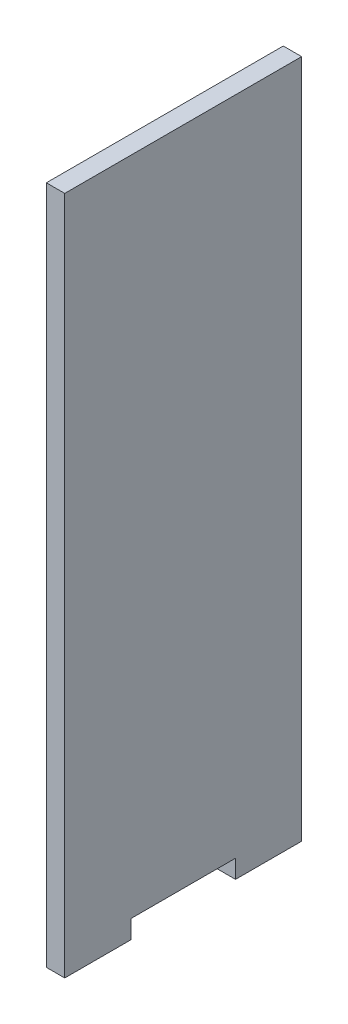
ISO-10303-21;
HEADER;
FILE_DESCRIPTION(('STEP AP214'),'2;1');
FILE_NAME('part.step','',(''),(''),'','','');
FILE_SCHEMA(('AUTOMOTIVE_DESIGN { 1 0 10303 214 1 1 1 1 }'));
ENDSEC;
DATA;
#1=APPLICATION_CONTEXT('core data for automotive mechanical design processes');
#2=APPLICATION_PROTOCOL_DEFINITION('international standard','automotive_design',2000,#1);
#3=PRODUCT_CONTEXT('',#1,'mechanical');
#4=PRODUCT('Part','Part','',(#3));
#5=PRODUCT_RELATED_PRODUCT_CATEGORY('part','',(#4));
#6=PRODUCT_DEFINITION_FORMATION('','',#4);
#7=PRODUCT_DEFINITION_CONTEXT('part definition',#1,'design');
#8=PRODUCT_DEFINITION('design','',#6,#7);
#9=PRODUCT_DEFINITION_SHAPE('','',#8);
#10=(LENGTH_UNIT() NAMED_UNIT(*) SI_UNIT(.MILLI.,.METRE.));
#11=(NAMED_UNIT(*) PLANE_ANGLE_UNIT() SI_UNIT($,.RADIAN.));
#12=(NAMED_UNIT(*) SI_UNIT($,.STERADIAN.) SOLID_ANGLE_UNIT());
#13=UNCERTAINTY_MEASURE_WITH_UNIT(LENGTH_MEASURE(1.E-05),#10,'distance_accuracy_value','');
#14=(GEOMETRIC_REPRESENTATION_CONTEXT(3) GLOBAL_UNCERTAINTY_ASSIGNED_CONTEXT((#13)) GLOBAL_UNIT_ASSIGNED_CONTEXT((#10,
#11,#12)) REPRESENTATION_CONTEXT('',''));
#15=CARTESIAN_POINT('',(0.,0.,0.));
#16=DIRECTION('',(0.,0.,1.));
#17=DIRECTION('',(1.,0.,0.));
#18=AXIS2_PLACEMENT_3D('',#15,#16,#17);
#19=CARTESIAN_POINT('',(5.,0.,32.25));
#20=DIRECTION('',(0.,0.,-1.));
#21=DIRECTION('',(-1.,0.,0.));
#22=AXIS2_PLACEMENT_3D('',#19,#20,#21);
#23=PLANE('',#22);
#24=DIRECTION('',(0.,-1.,0.));
#25=VECTOR('',#24,1.);
#26=CARTESIAN_POINT('',(0.,0.,32.25));
#27=LINE('',#26,#25);
#28=CARTESIAN_POINT('',(0.,180.,32.25));
#29=VERTEX_POINT('',#28);
#30=CARTESIAN_POINT('',(0.,-5.,32.25));
#31=VERTEX_POINT('',#30);
#32=EDGE_CURVE('E84',#29,#31,#27,.T.);
#33=ORIENTED_EDGE('',*,*,#32,.T.);
#34=DIRECTION('',(-1.,0.,0.));
#35=VECTOR('',#34,1.);
#36=CARTESIAN_POINT('',(5.,-5.,32.25));
#37=LINE('',#36,#35);
#38=CARTESIAN_POINT('',(5.,-5.,32.25));
#39=VERTEX_POINT('',#38);
#40=EDGE_CURVE('E11',#39,#31,#37,.T.);
#41=ORIENTED_EDGE('',*,*,#40,.F.);
#42=DIRECTION('',(0.,-1.,0.));
#43=VECTOR('',#42,1.);
#44=CARTESIAN_POINT('',(5.,180.,32.25));
#45=LINE('',#44,#43);
#46=CARTESIAN_POINT('',(5.,180.,32.25));
#47=VERTEX_POINT('',#46);
#48=EDGE_CURVE('E90',#47,#39,#45,.T.);
#49=ORIENTED_EDGE('',*,*,#48,.F.);
#50=DIRECTION('',(-1.,0.,0.));
#51=VECTOR('',#50,1.);
#52=CARTESIAN_POINT('',(5.,180.,32.25));
#53=LINE('',#52,#51);
#54=EDGE_CURVE('E125',#47,#29,#53,.T.);
#55=ORIENTED_EDGE('',*,*,#54,.T.);
#56=EDGE_LOOP('',(#33,#41,#49,#55));
#57=FACE_BOUND('',#56,.T.);
#58=ADVANCED_FACE('F33',(#57),#23,.F.);
#59=CARTESIAN_POINT('',(5.,-5.,32.25));
#60=DIRECTION('',(0.,1.,0.));
#61=DIRECTION('',(0.,0.,1.));
#62=AXIS2_PLACEMENT_3D('',#59,#60,#61);
#63=PLANE('',#62);
#64=DIRECTION('',(0.,0.,-1.));
#65=VECTOR('',#64,1.);
#66=CARTESIAN_POINT('',(0.,-5.,32.25));
#67=LINE('',#66,#65);
#68=CARTESIAN_POINT('',(0.,-5.00000000000002,14.25));
#69=VERTEX_POINT('',#68);
#70=EDGE_CURVE('E130',#31,#69,#67,.T.);
#71=ORIENTED_EDGE('',*,*,#70,.T.);
#72=DIRECTION('',(-1.,0.,0.));
#73=VECTOR('',#72,1.);
#74=CARTESIAN_POINT('',(5.,-5.00000000000002,14.25));
#75=LINE('',#74,#73);
#76=CARTESIAN_POINT('',(5.,-5.00000000000002,14.25));
#77=VERTEX_POINT('',#76);
#78=EDGE_CURVE('E41',#77,#69,#75,.T.);
#79=ORIENTED_EDGE('',*,*,#78,.F.);
#80=DIRECTION('',(0.,0.,-1.));
#81=VECTOR('',#80,1.);
#82=CARTESIAN_POINT('',(5.,-5.,32.25));
#83=LINE('',#82,#81);
#84=EDGE_CURVE('E174',#39,#77,#83,.T.);
#85=ORIENTED_EDGE('',*,*,#84,.F.);
#86=ORIENTED_EDGE('',*,*,#40,.T.);
#87=EDGE_LOOP('',(#71,#79,#85,#86));
#88=FACE_BOUND('',#87,.T.);
#89=ADVANCED_FACE('F176',(#88),#63,.F.);
#90=CARTESIAN_POINT('',(5.,-5.00000000000002,14.25));
#91=DIRECTION('',(0.,0.,1.));
#92=DIRECTION('',(1.,0.,0.));
#93=AXIS2_PLACEMENT_3D('',#90,#91,#92);
#94=PLANE('',#93);
#95=DIRECTION('',(0.,1.,0.));
#96=VECTOR('',#95,1.);
#97=CARTESIAN_POINT('',(0.,-5.00000000000002,14.25));
#98=LINE('',#97,#96);
#99=CARTESIAN_POINT('',(0.,0.,14.25));
#100=VERTEX_POINT('',#99);
#101=EDGE_CURVE('E132',#69,#100,#98,.T.);
#102=ORIENTED_EDGE('',*,*,#101,.T.);
#103=DIRECTION('',(-1.,0.,0.));
#104=VECTOR('',#103,1.);
#105=CARTESIAN_POINT('',(5.,0.,14.25));
#106=LINE('',#105,#104);
#107=CARTESIAN_POINT('',(5.,0.,14.25));
#108=VERTEX_POINT('',#107);
#109=EDGE_CURVE('E149',#108,#100,#106,.T.);
#110=ORIENTED_EDGE('',*,*,#109,.F.);
#111=DIRECTION('',(0.,1.,0.));
#112=VECTOR('',#111,1.);
#113=CARTESIAN_POINT('',(5.,-5.00000000000002,14.25));
#114=LINE('',#113,#112);
#115=EDGE_CURVE('E158',#77,#108,#114,.T.);
#116=ORIENTED_EDGE('',*,*,#115,.F.);
#117=ORIENTED_EDGE('',*,*,#78,.T.);
#118=EDGE_LOOP('',(#102,#110,#116,#117));
#119=FACE_BOUND('',#118,.T.);
#120=ADVANCED_FACE('F156',(#119),#94,.F.);
#121=CARTESIAN_POINT('',(5.,0.,14.25));
#122=DIRECTION('',(0.,1.,0.));
#123=DIRECTION('',(0.,0.,1.));
#124=AXIS2_PLACEMENT_3D('',#121,#122,#123);
#125=PLANE('',#124);
#126=DIRECTION('',(0.,0.,-1.));
#127=VECTOR('',#126,1.);
#128=CARTESIAN_POINT('',(0.,0.,14.25));
#129=LINE('',#128,#127);
#130=CARTESIAN_POINT('',(0.,0.,-14.25));
#131=VERTEX_POINT('',#130);
#132=EDGE_CURVE('E134',#100,#131,#129,.T.);
#133=ORIENTED_EDGE('',*,*,#132,.T.);
#134=DIRECTION('',(-1.,0.,0.));
#135=VECTOR('',#134,1.);
#136=CARTESIAN_POINT('',(5.,0.,-14.25));
#137=LINE('',#136,#135);
#138=CARTESIAN_POINT('',(5.,0.,-14.25));
#139=VERTEX_POINT('',#138);
#140=EDGE_CURVE('E146',#139,#131,#137,.T.);
#141=ORIENTED_EDGE('',*,*,#140,.F.);
#142=DIRECTION('',(0.,0.,-1.));
#143=VECTOR('',#142,1.);
#144=CARTESIAN_POINT('',(5.,0.,14.25));
#145=LINE('',#144,#143);
#146=EDGE_CURVE('E170',#108,#139,#145,.T.);
#147=ORIENTED_EDGE('',*,*,#146,.F.);
#148=ORIENTED_EDGE('',*,*,#109,.T.);
#149=EDGE_LOOP('',(#133,#141,#147,#148));
#150=FACE_BOUND('',#149,.T.);
#151=ADVANCED_FACE('F166',(#150),#125,.F.);
#152=CARTESIAN_POINT('',(5.,-5.00000000000002,-14.25));
#153=DIRECTION('',(0.,0.,-1.));
#154=DIRECTION('',(-1.,0.,0.));
#155=AXIS2_PLACEMENT_3D('',#152,#153,#154);
#156=PLANE('',#155);
#157=DIRECTION('',(0.,-1.,0.));
#158=VECTOR('',#157,1.);
#159=CARTESIAN_POINT('',(0.,-5.00000000000002,-14.25));
#160=LINE('',#159,#158);
#161=CARTESIAN_POINT('',(0.,-5.00000000000002,-14.25));
#162=VERTEX_POINT('',#161);
#163=EDGE_CURVE('E136',#131,#162,#160,.T.);
#164=ORIENTED_EDGE('',*,*,#163,.T.);
#165=DIRECTION('',(-1.,0.,0.));
#166=VECTOR('',#165,1.);
#167=CARTESIAN_POINT('',(5.,-5.00000000000002,-14.25));
#168=LINE('',#167,#166);
#169=CARTESIAN_POINT('',(5.,-5.00000000000002,-14.25));
#170=VERTEX_POINT('',#169);
#171=EDGE_CURVE('E120',#170,#162,#168,.T.);
#172=ORIENTED_EDGE('',*,*,#171,.F.);
#173=DIRECTION('',(0.,-1.,0.));
#174=VECTOR('',#173,1.);
#175=CARTESIAN_POINT('',(5.,-5.00000000000002,-14.25));
#176=LINE('',#175,#174);
#177=EDGE_CURVE('E110',#139,#170,#176,.T.);
#178=ORIENTED_EDGE('',*,*,#177,.F.);
#179=ORIENTED_EDGE('',*,*,#140,.T.);
#180=EDGE_LOOP('',(#164,#172,#178,#179));
#181=FACE_BOUND('',#180,.T.);
#182=ADVANCED_FACE('F169',(#181),#156,.F.);
#183=CARTESIAN_POINT('',(5.,-4.99999999999999,-32.25));
#184=DIRECTION('',(0.,1.,0.));
#185=DIRECTION('',(0.,0.,1.));
#186=AXIS2_PLACEMENT_3D('',#183,#184,#185);
#187=PLANE('',#186);
#188=DIRECTION('',(0.,0.,-1.));
#189=VECTOR('',#188,1.);
#190=CARTESIAN_POINT('',(0.,-4.99999999999999,-32.25));
#191=LINE('',#190,#189);
#192=CARTESIAN_POINT('',(0.,-4.99999999999999,-32.25));
#193=VERTEX_POINT('',#192);
#194=EDGE_CURVE('E119',#162,#193,#191,.T.);
#195=ORIENTED_EDGE('',*,*,#194,.T.);
#196=DIRECTION('',(-1.,0.,0.));
#197=VECTOR('',#196,1.);
#198=CARTESIAN_POINT('',(5.,-4.99999999999999,-32.25));
#199=LINE('',#198,#197);
#200=CARTESIAN_POINT('',(5.,-4.99999999999999,-32.25));
#201=VERTEX_POINT('',#200);
#202=EDGE_CURVE('E116',#201,#193,#199,.T.);
#203=ORIENTED_EDGE('',*,*,#202,.F.);
#204=DIRECTION('',(0.,0.,-1.));
#205=VECTOR('',#204,1.);
#206=CARTESIAN_POINT('',(5.,-4.99999999999999,-32.25));
#207=LINE('',#206,#205);
#208=EDGE_CURVE('E104',#170,#201,#207,.T.);
#209=ORIENTED_EDGE('',*,*,#208,.F.);
#210=ORIENTED_EDGE('',*,*,#171,.T.);
#211=EDGE_LOOP('',(#195,#203,#209,#210));
#212=FACE_BOUND('',#211,.T.);
#213=ADVANCED_FACE('F117',(#212),#187,.F.);
#214=CARTESIAN_POINT('',(5.,180.,-32.25));
#215=DIRECTION('',(0.,0.,1.));
#216=DIRECTION('',(0.,-1.,0.));
#217=AXIS2_PLACEMENT_3D('',#214,#215,#216);
#218=PLANE('',#217);
#219=DIRECTION('',(0.,1.,0.));
#220=VECTOR('',#219,1.);
#221=CARTESIAN_POINT('',(0.,180.,-32.25));
#222=LINE('',#221,#220);
#223=CARTESIAN_POINT('',(0.,180.,-32.25));
#224=VERTEX_POINT('',#223);
#225=EDGE_CURVE('E77',#193,#224,#222,.T.);
#226=ORIENTED_EDGE('',*,*,#225,.T.);
#227=DIRECTION('',(-1.,0.,0.));
#228=VECTOR('',#227,1.);
#229=CARTESIAN_POINT('',(5.,180.,-32.25));
#230=LINE('',#229,#228);
#231=CARTESIAN_POINT('',(5.,180.,-32.25));
#232=VERTEX_POINT('',#231);
#233=EDGE_CURVE('E121',#232,#224,#230,.T.);
#234=ORIENTED_EDGE('',*,*,#233,.F.);
#235=DIRECTION('',(0.,1.,0.));
#236=VECTOR('',#235,1.);
#237=CARTESIAN_POINT('',(5.,0.,-32.25));
#238=LINE('',#237,#236);
#239=EDGE_CURVE('E108',#201,#232,#238,.T.);
#240=ORIENTED_EDGE('',*,*,#239,.F.);
#241=ORIENTED_EDGE('',*,*,#202,.T.);
#242=EDGE_LOOP('',(#226,#234,#240,#241));
#243=FACE_BOUND('',#242,.T.);
#244=ADVANCED_FACE('F123',(#243),#218,.F.);
#245=CARTESIAN_POINT('',(5.,180.,32.25));
#246=DIRECTION('',(0.,-1.,0.));
#247=DIRECTION('',(0.,0.,-1.));
#248=AXIS2_PLACEMENT_3D('',#245,#246,#247);
#249=PLANE('',#248);
#250=DIRECTION('',(0.,0.,1.));
#251=VECTOR('',#250,1.);
#252=CARTESIAN_POINT('',(0.,180.,32.25));
#253=LINE('',#252,#251);
#254=EDGE_CURVE('E140',#224,#29,#253,.T.);
#255=ORIENTED_EDGE('',*,*,#254,.T.);
#256=ORIENTED_EDGE('',*,*,#54,.F.);
#257=DIRECTION('',(0.,0.,1.));
#258=VECTOR('',#257,1.);
#259=CARTESIAN_POINT('',(5.,180.,32.25));
#260=LINE('',#259,#258);
#261=EDGE_CURVE('E49',#232,#47,#260,.T.);
#262=ORIENTED_EDGE('',*,*,#261,.F.);
#263=ORIENTED_EDGE('',*,*,#233,.T.);
#264=EDGE_LOOP('',(#255,#256,#262,#263));
#265=FACE_BOUND('',#264,.T.);
#266=ADVANCED_FACE('F179',(#265),#249,.F.);
#267=CARTESIAN_POINT('',(5.,0.,0.));
#268=DIRECTION('',(1.,0.,0.));
#269=DIRECTION('',(0.,0.,-1.));
#270=AXIS2_PLACEMENT_3D('',#267,#268,#269);
#271=PLANE('',#270);
#272=ORIENTED_EDGE('',*,*,#48,.T.);
#273=ORIENTED_EDGE('',*,*,#84,.T.);
#274=ORIENTED_EDGE('',*,*,#115,.T.);
#275=ORIENTED_EDGE('',*,*,#146,.T.);
#276=ORIENTED_EDGE('',*,*,#177,.T.);
#277=ORIENTED_EDGE('',*,*,#208,.T.);
#278=ORIENTED_EDGE('',*,*,#239,.T.);
#279=ORIENTED_EDGE('',*,*,#261,.T.);
#280=EDGE_LOOP('',(#272,#273,#274,#275,#276,#277,#278,#279));
#281=FACE_BOUND('',#280,.T.);
#282=ADVANCED_FACE('F106',(#281),#271,.T.);
#283=CARTESIAN_POINT('',(0.,0.,0.));
#284=DIRECTION('',(1.,0.,0.));
#285=DIRECTION('',(0.,0.,-1.));
#286=AXIS2_PLACEMENT_3D('',#283,#284,#285);
#287=PLANE('',#286);
#288=ORIENTED_EDGE('',*,*,#32,.F.);
#289=ORIENTED_EDGE('',*,*,#254,.F.);
#290=ORIENTED_EDGE('',*,*,#225,.F.);
#291=ORIENTED_EDGE('',*,*,#194,.F.);
#292=ORIENTED_EDGE('',*,*,#163,.F.);
#293=ORIENTED_EDGE('',*,*,#132,.F.);
#294=ORIENTED_EDGE('',*,*,#101,.F.);
#295=ORIENTED_EDGE('',*,*,#70,.F.);
#296=EDGE_LOOP('',(#288,#289,#290,#291,#292,#293,#294,#295));
#297=FACE_BOUND('',#296,.T.);
#298=ADVANCED_FACE('F162',(#297),#287,.F.);
#299=CLOSED_SHELL('',(#58,#89,#120,#151,#182,#213,#244,#266,#282,#298));
#300=MANIFOLD_SOLID_BREP('B2',#299);
#301=ADVANCED_BREP_SHAPE_REPRESENTATION('',(#18,#300),#14);
#302=SHAPE_DEFINITION_REPRESENTATION(#9,#301);
ENDSEC;
END-ISO-10303-21;
